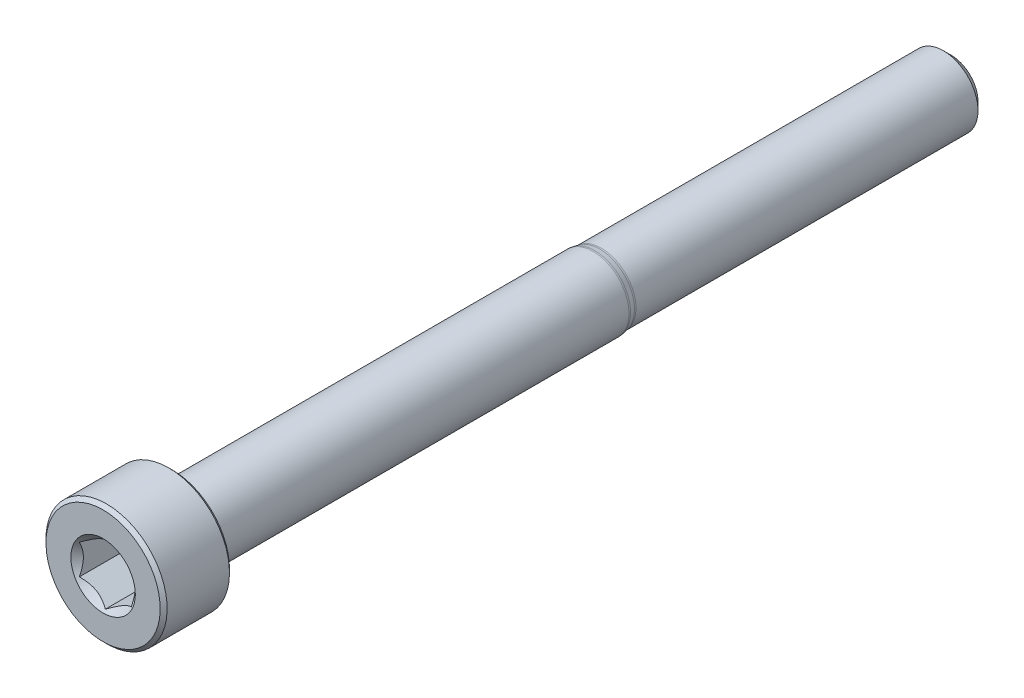
ISO-10303-21;
HEADER;
FILE_DESCRIPTION(('STEP AP214'),'2;1');
FILE_NAME('part.step','',(''),(''),'','','');
FILE_SCHEMA(('AUTOMOTIVE_DESIGN { 1 0 10303 214 1 1 1 1 }'));
ENDSEC;
DATA;
#1=APPLICATION_CONTEXT('core data for automotive mechanical design processes');
#2=APPLICATION_PROTOCOL_DEFINITION('international standard','automotive_design',2000,#1);
#3=PRODUCT_CONTEXT('',#1,'mechanical');
#4=PRODUCT('Part','Part','',(#3));
#5=PRODUCT_RELATED_PRODUCT_CATEGORY('part','',(#4));
#6=PRODUCT_DEFINITION_FORMATION('','',#4);
#7=PRODUCT_DEFINITION_CONTEXT('part definition',#1,'design');
#8=PRODUCT_DEFINITION('design','',#6,#7);
#9=PRODUCT_DEFINITION_SHAPE('','',#8);
#10=(LENGTH_UNIT() NAMED_UNIT(*) SI_UNIT(.MILLI.,.METRE.));
#11=(NAMED_UNIT(*) PLANE_ANGLE_UNIT() SI_UNIT($,.RADIAN.));
#12=(NAMED_UNIT(*) SI_UNIT($,.STERADIAN.) SOLID_ANGLE_UNIT());
#13=UNCERTAINTY_MEASURE_WITH_UNIT(LENGTH_MEASURE(1.E-05),#10,'distance_accuracy_value','');
#14=(GEOMETRIC_REPRESENTATION_CONTEXT(3) GLOBAL_UNCERTAINTY_ASSIGNED_CONTEXT((#13)) GLOBAL_UNIT_ASSIGNED_CONTEXT((#10,
#11,#12)) REPRESENTATION_CONTEXT('',''));
#15=CARTESIAN_POINT('',(0.,0.,0.));
#16=DIRECTION('',(0.,0.,1.));
#17=DIRECTION('',(1.,0.,0.));
#18=AXIS2_PLACEMENT_3D('',#15,#16,#17);
#19=CARTESIAN_POINT('',(0.,1.54533666301317,-24.5));
#20=DIRECTION('',(0.,0.,-1.));
#21=DIRECTION('',(0.,1.,0.));
#22=AXIS2_PLACEMENT_3D('',#19,#20,#21);
#23=PLANE('',#22);
#24=CARTESIAN_POINT('',(0.,0.,-24.5));
#25=DIRECTION('',(0.,0.,-1.));
#26=DIRECTION('',(0.,1.,0.));
#27=AXIS2_PLACEMENT_3D('',#24,#25,#26);
#28=CIRCLE('',#27,1.54533666301317);
#29=CARTESIAN_POINT('',(0.,1.54533666301317,-24.5));
#30=VERTEX_POINT('',#29);
#31=EDGE_CURVE('E51',#30,#30,#28,.T.);
#32=ORIENTED_EDGE('',*,*,#31,.T.);
#33=EDGE_LOOP('',(#32));
#34=FACE_BOUND('',#33,.T.);
#35=ADVANCED_FACE('F38',(#34),#23,.T.);
#36=CARTESIAN_POINT('',(0.,0.,-24.5));
#37=DIRECTION('',(0.,0.,1.));
#38=DIRECTION('',(0.,-1.,0.));
#39=AXIS2_PLACEMENT_3D('',#36,#37,#38);
#40=CONICAL_SURFACE('',#39,1.54533666301317,0.785398163397439);
#41=CARTESIAN_POINT('',(0.,0.,-24.0453366630132));
#42=DIRECTION('',(0.,0.,-1.));
#43=DIRECTION('',(0.,1.,0.));
#44=AXIS2_PLACEMENT_3D('',#41,#42,#43);
#45=CIRCLE('',#44,2.);
#46=CARTESIAN_POINT('',(0.,2.,-24.0453366630132));
#47=VERTEX_POINT('',#46);
#48=EDGE_CURVE('E166',#47,#47,#45,.T.);
#49=ORIENTED_EDGE('',*,*,#48,.T.);
#50=EDGE_LOOP('',(#49));
#51=FACE_BOUND('',#50,.T.);
#52=ORIENTED_EDGE('',*,*,#31,.F.);
#53=EDGE_LOOP('',(#52));
#54=FACE_BOUND('',#53,.T.);
#55=ADVANCED_FACE('F172',(#51,#54),#40,.T.);
#56=CARTESIAN_POINT('',(0.,0.,-24.5));
#57=DIRECTION('',(0.,0.,-1.));
#58=DIRECTION('',(0.,1.,0.));
#59=AXIS2_PLACEMENT_3D('',#56,#57,#58);
#60=CYLINDRICAL_SURFACE('',#59,2.);
#61=CARTESIAN_POINT('',(0.,0.,-4.28674570167858));
#62=DIRECTION('',(0.,0.,-1.));
#63=DIRECTION('',(0.,1.,0.));
#64=AXIS2_PLACEMENT_3D('',#61,#62,#63);
#65=CIRCLE('',#64,2.);
#66=CARTESIAN_POINT('',(0.,2.,-4.28674570167858));
#67=VERTEX_POINT('',#66);
#68=EDGE_CURVE('E163',#67,#67,#65,.T.);
#69=ORIENTED_EDGE('',*,*,#68,.T.);
#70=EDGE_LOOP('',(#69));
#71=FACE_BOUND('',#70,.T.);
#72=ORIENTED_EDGE('',*,*,#48,.F.);
#73=EDGE_LOOP('',(#72));
#74=FACE_BOUND('',#73,.T.);
#75=ADVANCED_FACE('F174',(#71,#74),#60,.T.);
#76=CARTESIAN_POINT('',(0.,0.,-4.28674570167858));
#77=DIRECTION('',(0.,0.,-1.));
#78=DIRECTION('',(0.,1.,0.));
#79=AXIS2_PLACEMENT_3D('',#76,#77,#78);
#80=TOROIDAL_SURFACE('',#79,2.5,0.5);
#81=CARTESIAN_POINT('',(0.,0.,-4.18920054067052));
#82=DIRECTION('',(0.,0.,-1.));
#83=DIRECTION('',(0.,1.,0.));
#84=AXIS2_PLACEMENT_3D('',#81,#82,#83);
#85=CIRCLE('',#84,2.00960735979838);
#86=CARTESIAN_POINT('',(0.,2.00960735979838,-4.18920054067052));
#87=VERTEX_POINT('',#86);
#88=EDGE_CURVE('E160',#87,#87,#85,.T.);
#89=ORIENTED_EDGE('',*,*,#88,.T.);
#90=EDGE_LOOP('',(#89));
#91=FACE_BOUND('',#90,.T.);
#92=ORIENTED_EDGE('',*,*,#68,.F.);
#93=EDGE_LOOP('',(#92));
#94=FACE_BOUND('',#93,.T.);
#95=ADVANCED_FACE('F180',(#91,#94),#80,.F.);
#96=CARTESIAN_POINT('',(0.,0.,-4.18920054067052));
#97=DIRECTION('',(0.,0.,1.));
#98=DIRECTION('',(0.,-1.,0.));
#99=AXIS2_PLACEMENT_3D('',#96,#97,#98);
#100=CONICAL_SURFACE('',#99,2.00960735979838,0.196349540849355);
#101=CARTESIAN_POINT('',(0.,0.,-3.90484163438686));
#102=DIRECTION('',(0.,0.,-1.));
#103=DIRECTION('',(0.,1.,0.));
#104=AXIS2_PLACEMENT_3D('',#101,#102,#103);
#105=CIRCLE('',#104,2.06616986303275);
#106=CARTESIAN_POINT('',(0.,2.06616986303275,-3.90484163438686));
#107=VERTEX_POINT('',#106);
#108=EDGE_CURVE('E157',#107,#107,#105,.T.);
#109=ORIENTED_EDGE('',*,*,#108,.T.);
#110=EDGE_LOOP('',(#109));
#111=FACE_BOUND('',#110,.T.);
#112=ORIENTED_EDGE('',*,*,#88,.F.);
#113=EDGE_LOOP('',(#112));
#114=FACE_BOUND('',#113,.T.);
#115=ADVANCED_FACE('F186',(#111,#114),#100,.T.);
#116=CARTESIAN_POINT('',(0.,0.,-3.8072964733788));
#117=DIRECTION('',(0.,0.,-1.));
#118=DIRECTION('',(0.,1.,0.));
#119=AXIS2_PLACEMENT_3D('',#116,#117,#118);
#120=TOROIDAL_SURFACE('',#119,1.57577722283114,0.5);
#121=CARTESIAN_POINT('',(0.,0.,-3.8072964733788));
#122=DIRECTION('',(0.,0.,-1.));
#123=DIRECTION('',(0.,1.,0.));
#124=AXIS2_PLACEMENT_3D('',#121,#122,#123);
#125=CIRCLE('',#124,2.07577722283114);
#126=CARTESIAN_POINT('',(0.,2.07577722283114,-3.8072964733788));
#127=VERTEX_POINT('',#126);
#128=EDGE_CURVE('E154',#127,#127,#125,.T.);
#129=ORIENTED_EDGE('',*,*,#128,.T.);
#130=EDGE_LOOP('',(#129));
#131=FACE_BOUND('',#130,.T.);
#132=ORIENTED_EDGE('',*,*,#108,.F.);
#133=EDGE_LOOP('',(#132));
#134=FACE_BOUND('',#133,.T.);
#135=ADVANCED_FACE('F190',(#131,#134),#120,.T.);
#136=CARTESIAN_POINT('',(0.,0.,-24.5));
#137=DIRECTION('',(0.,0.,-1.));
#138=DIRECTION('',(0.,1.,0.));
#139=AXIS2_PLACEMENT_3D('',#136,#137,#138);
#140=CYLINDRICAL_SURFACE('',#139,2.07577722283114);
#141=CARTESIAN_POINT('',(0.,0.,20.3));
#142=DIRECTION('',(0.,0.,-1.));
#143=DIRECTION('',(0.,1.,0.));
#144=AXIS2_PLACEMENT_3D('',#141,#142,#143);
#145=CIRCLE('',#144,2.07577722283114);
#146=CARTESIAN_POINT('',(0.,2.07577722283114,20.3));
#147=VERTEX_POINT('',#146);
#148=EDGE_CURVE('E151',#147,#147,#145,.T.);
#149=ORIENTED_EDGE('',*,*,#148,.T.);
#150=EDGE_LOOP('',(#149));
#151=FACE_BOUND('',#150,.T.);
#152=ORIENTED_EDGE('',*,*,#128,.F.);
#153=EDGE_LOOP('',(#152));
#154=FACE_BOUND('',#153,.T.);
#155=ADVANCED_FACE('F194',(#151,#154),#140,.T.);
#156=CARTESIAN_POINT('',(0.,0.,20.3));
#157=DIRECTION('',(0.,0.,-1.));
#158=DIRECTION('',(0.,1.,0.));
#159=AXIS2_PLACEMENT_3D('',#156,#157,#158);
#160=TOROIDAL_SURFACE('',#159,2.27577722283114,0.2);
#161=CARTESIAN_POINT('',(0.,0.,20.5));
#162=DIRECTION('',(0.,0.,-1.));
#163=DIRECTION('',(0.,1.,0.));
#164=AXIS2_PLACEMENT_3D('',#161,#162,#163);
#165=CIRCLE('',#164,2.27577722283114);
#166=CARTESIAN_POINT('',(0.,2.27577722283114,20.5));
#167=VERTEX_POINT('',#166);
#168=EDGE_CURVE('E148',#167,#167,#165,.T.);
#169=ORIENTED_EDGE('',*,*,#168,.T.);
#170=EDGE_LOOP('',(#169));
#171=FACE_BOUND('',#170,.T.);
#172=ORIENTED_EDGE('',*,*,#148,.F.);
#173=EDGE_LOOP('',(#172));
#174=FACE_BOUND('',#173,.T.);
#175=ADVANCED_FACE('F198',(#171,#174),#160,.F.);
#176=CARTESIAN_POINT('',(0.,3.3,20.5));
#177=DIRECTION('',(0.,0.,-1.));
#178=DIRECTION('',(0.,1.,0.));
#179=AXIS2_PLACEMENT_3D('',#176,#177,#178);
#180=PLANE('',#179);
#181=CARTESIAN_POINT('',(0.,0.,20.5));
#182=DIRECTION('',(0.,0.,-1.));
#183=DIRECTION('',(0.,1.,0.));
#184=AXIS2_PLACEMENT_3D('',#181,#182,#183);
#185=CIRCLE('',#184,3.3);
#186=CARTESIAN_POINT('',(0.,3.3,20.5));
#187=VERTEX_POINT('',#186);
#188=EDGE_CURVE('E145',#187,#187,#185,.T.);
#189=ORIENTED_EDGE('',*,*,#188,.T.);
#190=EDGE_LOOP('',(#189));
#191=FACE_BOUND('',#190,.T.);
#192=ORIENTED_EDGE('',*,*,#168,.F.);
#193=EDGE_LOOP('',(#192));
#194=FACE_BOUND('',#193,.T.);
#195=ADVANCED_FACE('F202',(#191,#194),#180,.T.);
#196=CARTESIAN_POINT('',(0.,0.,20.5));
#197=DIRECTION('',(0.,0.,1.));
#198=DIRECTION('',(0.,-1.,0.));
#199=AXIS2_PLACEMENT_3D('',#196,#197,#198);
#200=CONICAL_SURFACE('',#199,3.3,0.785398163397452);
#201=CARTESIAN_POINT('',(0.,0.,20.7));
#202=DIRECTION('',(0.,0.,-1.));
#203=DIRECTION('',(0.,1.,0.));
#204=AXIS2_PLACEMENT_3D('',#201,#202,#203);
#205=CIRCLE('',#204,3.5);
#206=CARTESIAN_POINT('',(0.,3.5,20.7));
#207=VERTEX_POINT('',#206);
#208=EDGE_CURVE('E142',#207,#207,#205,.T.);
#209=ORIENTED_EDGE('',*,*,#208,.T.);
#210=EDGE_LOOP('',(#209));
#211=FACE_BOUND('',#210,.T.);
#212=ORIENTED_EDGE('',*,*,#188,.F.);
#213=EDGE_LOOP('',(#212));
#214=FACE_BOUND('',#213,.T.);
#215=ADVANCED_FACE('F206',(#211,#214),#200,.T.);
#216=CARTESIAN_POINT('',(0.,0.,-24.5));
#217=DIRECTION('',(0.,0.,-1.));
#218=DIRECTION('',(0.,1.,0.));
#219=AXIS2_PLACEMENT_3D('',#216,#217,#218);
#220=CYLINDRICAL_SURFACE('',#219,3.5);
#221=CARTESIAN_POINT('',(0.,0.,24.3));
#222=DIRECTION('',(0.,0.,-1.));
#223=DIRECTION('',(0.,1.,0.));
#224=AXIS2_PLACEMENT_3D('',#221,#222,#223);
#225=CIRCLE('',#224,3.5);
#226=CARTESIAN_POINT('',(0.,3.5,24.3));
#227=VERTEX_POINT('',#226);
#228=EDGE_CURVE('E139',#227,#227,#225,.T.);
#229=ORIENTED_EDGE('',*,*,#228,.T.);
#230=EDGE_LOOP('',(#229));
#231=FACE_BOUND('',#230,.T.);
#232=ORIENTED_EDGE('',*,*,#208,.F.);
#233=EDGE_LOOP('',(#232));
#234=FACE_BOUND('',#233,.T.);
#235=ADVANCED_FACE('F210',(#231,#234),#220,.T.);
#236=CARTESIAN_POINT('',(0.,0.,24.3));
#237=DIRECTION('',(0.,0.,-1.));
#238=DIRECTION('',(0.,1.,0.));
#239=AXIS2_PLACEMENT_3D('',#236,#237,#238);
#240=CONICAL_SURFACE('',#239,3.5,0.785398163397452);
#241=CARTESIAN_POINT('',(0.,0.,24.5));
#242=DIRECTION('',(0.,0.,-1.));
#243=DIRECTION('',(0.,1.,0.));
#244=AXIS2_PLACEMENT_3D('',#241,#242,#243);
#245=CIRCLE('',#244,3.3);
#246=CARTESIAN_POINT('',(0.,3.3,24.5));
#247=VERTEX_POINT('',#246);
#248=EDGE_CURVE('E136',#247,#247,#245,.T.);
#249=ORIENTED_EDGE('',*,*,#248,.T.);
#250=EDGE_LOOP('',(#249));
#251=FACE_BOUND('',#250,.T.);
#252=ORIENTED_EDGE('',*,*,#228,.F.);
#253=EDGE_LOOP('',(#252));
#254=FACE_BOUND('',#253,.T.);
#255=ADVANCED_FACE('F214',(#251,#254),#240,.T.);
#256=CARTESIAN_POINT('',(0.,0.,24.5));
#257=DIRECTION('',(0.,0.,1.));
#258=DIRECTION('',(0.,-1.,0.));
#259=AXIS2_PLACEMENT_3D('',#256,#257,#258);
#260=PLANE('',#259);
#261=CARTESIAN_POINT('',(0.,0.,24.5));
#262=DIRECTION('',(0.,0.,1.));
#263=DIRECTION('',(1.,0.,0.));
#264=AXIS2_PLACEMENT_3D('',#261,#262,#263);
#265=CIRCLE('',#264,1.86195461813654);
#266=CARTESIAN_POINT('',(1.86195461813654,0.,24.5));
#267=VERTEX_POINT('',#266);
#268=EDGE_CURVE('E110',#267,#267,#265,.T.);
#269=ORIENTED_EDGE('',*,*,#268,.F.);
#270=EDGE_LOOP('',(#269));
#271=FACE_BOUND('',#270,.T.);
#272=ORIENTED_EDGE('',*,*,#248,.F.);
#273=EDGE_LOOP('',(#272));
#274=FACE_BOUND('',#273,.T.);
#275=ADVANCED_FACE('F218',(#271,#274),#260,.T.);
#276=CARTESIAN_POINT('',(0.,0.,24.5));
#277=DIRECTION('',(0.,0.,1.));
#278=DIRECTION('',(1.,0.,0.));
#279=AXIS2_PLACEMENT_3D('',#276,#277,#278);
#280=CONICAL_SURFACE('',#279,1.86195461813654,0.78539816339745);
#281=ORIENTED_EDGE('',*,*,#268,.T.);
#282=EDGE_LOOP('',(#281));
#283=FACE_BOUND('',#282,.T.);
#284=CARTESIAN_POINT('',(-0.000199999999999613,-1.73216627762272,24.3702116710324));
#285=CARTESIAN_POINT('',(0.051367790737076,-1.70239359975915,24.3404616654997));
#286=CARTESIAN_POINT('',(0.103797917665201,-1.67212305186355,24.3124586733426));
#287=CARTESIAN_POINT('',(0.210709034055597,-1.61039789003619,24.2611854198725));
#288=CARTESIAN_POINT('',(0.265200195814662,-1.57893740312614,24.2379436944767));
#289=CARTESIAN_POINT('',(0.37507908135725,-1.51549879897987,24.1981299184246));
#290=CARTESIAN_POINT('',(0.430438809095201,-1.4835368452681,24.1814577751032));
#291=CARTESIAN_POINT('',(0.542377257477151,-1.41890915196211,24.1557706462504));
#292=CARTESIAN_POINT('',(0.598952556553009,-1.38624538781118,24.1467364799112));
#293=CARTESIAN_POINT('',(0.696455389516442,-1.32995210095299,24.1385852706592));
#294=CARTESIAN_POINT('',(0.737256908280467,-1.30639533311124,24.1373784424216));
#295=CARTESIAN_POINT('',(0.818787969615859,-1.25932335290193,24.1394102465946));
#296=CARTESIAN_POINT('',(0.859517494314631,-1.23580815085313,24.1426498601806));
#297=CARTESIAN_POINT('',(0.940584402163417,-1.18900414978426,24.1533881754143));
#298=CARTESIAN_POINT('',(0.980921384598289,-1.16571558211719,24.1608908424511));
#299=CARTESIAN_POINT('',(1.06091833691403,-1.11952932016335,24.1797478013606));
#300=CARTESIAN_POINT('',(1.10057800851621,-1.09663179808786,24.1911037464509));
#301=CARTESIAN_POINT('',(1.20216313477449,-1.03798159809698,24.224817837025));
#302=CARTESIAN_POINT('',(1.26345855370969,-1.00259267147465,24.2497180385257));
#303=CARTESIAN_POINT('',(1.35358562846331,-0.950557780604375,24.2917528427039));
#304=CARTESIAN_POINT('',(1.38328513990772,-0.933410759677148,24.3065213429914));
#305=CARTESIAN_POINT('',(1.44213790138375,-0.899432101996407,24.3374067553725));
#306=CARTESIAN_POINT('',(1.47129140422064,-0.88260031928571,24.353523023554));
#307=CARTESIAN_POINT('',(1.5002,-0.8659099337306,24.3702116710324));
#308=B_SPLINE_CURVE_WITH_KNOTS('',3,(#284,#285,#286,#287,#288,#289,#290,#291,#292,#293,#294,
#295,#296,#297,#298,#299,#300,#301,#302,#303,#304,#305,#306,#307),.UNSPECIFIED.,.F.,.F.,(4,2,2,
2,2,2,2,2,2,2,2,4),(0.,0.199829143693306,0.40082298738239,0.598623720538182,0.79592624018889,
0.937113067959882,1.07833105577193,1.21968061668222,1.36109089931055,1.58570969637565,
1.69770705470963,1.80965120737194),.UNSPECIFIED.);
#309=CARTESIAN_POINT('',(0.,-1.73205080756888,24.3700961894323));
#310=VERTEX_POINT('',#309);
#311=CARTESIAN_POINT('',(1.5,-0.866025403784438,24.3700961894323));
#312=VERTEX_POINT('',#311);
#313=EDGE_CURVE('E12',#310,#312,#308,.T.);
#314=ORIENTED_EDGE('',*,*,#313,.F.);
#315=CARTESIAN_POINT('',(-1.5002,-0.865909933730601,24.3702116710324));
#316=CARTESIAN_POINT('',(-1.44863220926292,-0.895682611594166,24.3404616654997));
#317=CARTESIAN_POINT('',(-1.3962020823348,-0.925953159489766,24.3124586733426));
#318=CARTESIAN_POINT('',(-1.2892909659444,-0.987678321317124,24.2611854198725));
#319=CARTESIAN_POINT('',(-1.23479980418534,-1.01913880822718,24.2379436944767));
#320=CARTESIAN_POINT('',(-1.12492091864275,-1.08257741237344,24.1981299184246));
#321=CARTESIAN_POINT('',(-1.0695611909048,-1.11453936608521,24.1814577751032));
#322=CARTESIAN_POINT('',(-0.957622742522848,-1.1791670593912,24.1557706462504));
#323=CARTESIAN_POINT('',(-0.90104744344699,-1.21183082354213,24.1467364799112));
#324=CARTESIAN_POINT('',(-0.803544610483558,-1.26812411040032,24.1385852706592));
#325=CARTESIAN_POINT('',(-0.762743091719533,-1.29168087824208,24.1373784424216));
#326=CARTESIAN_POINT('',(-0.681212030384141,-1.33875285845138,24.1394102465946));
#327=CARTESIAN_POINT('',(-0.640482505685369,-1.36226806050018,24.1426498601806));
#328=CARTESIAN_POINT('',(-0.559415597836583,-1.40907206156905,24.1533881754143));
#329=CARTESIAN_POINT('',(-0.519078615401711,-1.43236062923612,24.1608908424511));
#330=CARTESIAN_POINT('',(-0.439081663085968,-1.47854689118997,24.1797478013606));
#331=CARTESIAN_POINT('',(-0.399421991483791,-1.50144441326545,24.1911037464509));
#332=CARTESIAN_POINT('',(-0.297836865225514,-1.56009461325633,24.224817837025));
#333=CARTESIAN_POINT('',(-0.23654144629031,-1.59548353987866,24.2497180385257));
#334=CARTESIAN_POINT('',(-0.146414371536686,-1.64751843074894,24.2917528427039));
#335=CARTESIAN_POINT('',(-0.116714860092282,-1.66466545167617,24.3065213429914));
#336=CARTESIAN_POINT('',(-0.057862098616249,-1.69864410935691,24.3374067553725));
#337=CARTESIAN_POINT('',(-0.0287085957793625,-1.71547589206761,24.353523023554));
#338=CARTESIAN_POINT('',(0.000200000000000539,-1.73216627762272,24.3702116710324));
#339=B_SPLINE_CURVE_WITH_KNOTS('',3,(#315,#316,#317,#318,#319,#320,#321,#322,#323,#324,#325,
#326,#327,#328,#329,#330,#331,#332,#333,#334,#335,#336,#337,#338),.UNSPECIFIED.,.F.,.F.,(4,2,2,
2,2,2,2,2,2,2,2,4),(0.,0.199829143693306,0.40082298738239,0.598623720538182,0.795926240188891,
0.937113067959882,1.07833105577193,1.21968061668222,1.36109089931055,1.58570969637566,
1.69770705470964,1.80965120737194),.UNSPECIFIED.);
#340=CARTESIAN_POINT('',(-1.5,-0.866025403784439,24.3700961894323));
#341=VERTEX_POINT('',#340);
#342=EDGE_CURVE('E96',#341,#310,#339,.T.);
#343=ORIENTED_EDGE('',*,*,#342,.F.);
#344=CARTESIAN_POINT('',(-1.5,-1.81798644339826,24.9949659805218));
#345=CARTESIAN_POINT('',(-1.5,-1.7741049212163,24.9611234480288));
#346=CARTESIAN_POINT('',(-1.5,-1.7299890896826,24.927585707746));
#347=CARTESIAN_POINT('',(-1.5,-1.64119040614349,24.8612482560218));
#348=CARTESIAN_POINT('',(-1.5,-1.59650742345673,24.8284487196869));
#349=CARTESIAN_POINT('',(-1.5,-1.46080703724549,24.7308819989223));
#350=CARTESIAN_POINT('',(-1.5,-1.36880260139859,24.6674654805716));
#351=CARTESIAN_POINT('',(-1.5,-1.17526244907484,24.5421024160959));
#352=CARTESIAN_POINT('',(-1.5,-1.07349399309978,24.4805114517827));
#353=CARTESIAN_POINT('',(-1.5,-0.864764886493364,24.367252227632));
#354=CARTESIAN_POINT('',(-1.5,-0.757823368449898,24.3155504543104));
#355=CARTESIAN_POINT('',(-1.5,-0.598146096468989,24.2522731835563));
#356=CARTESIAN_POINT('',(-1.5,-0.547969975291046,24.2342740943257));
#357=CARTESIAN_POINT('',(-1.5,-0.446326905726014,24.2022954757007));
#358=CARTESIAN_POINT('',(-1.5,-0.39485987612543,24.1883161998935));
#359=CARTESIAN_POINT('',(-1.5,-0.291848443786788,24.1653656993307));
#360=CARTESIAN_POINT('',(-1.5,-0.240324799163318,24.1563028233891));
#361=CARTESIAN_POINT('',(-1.5,-0.136625504447977,24.1433771204074));
#362=CARTESIAN_POINT('',(-1.5,-0.0844499953262876,24.1395131880538));
#363=CARTESIAN_POINT('',(-1.5,0.017680632277305,24.1373196118873));
#364=CARTESIAN_POINT('',(-1.5,0.0676306379007709,24.1387500662965));
#365=CARTESIAN_POINT('',(-1.5,0.167145406902043,24.1465133064628));
#366=CARTESIAN_POINT('',(-1.5,0.216710135235096,24.1528465330246));
#367=CARTESIAN_POINT('',(-1.5,0.315937074154246,24.1701627013475));
#368=CARTESIAN_POINT('',(-1.5,0.365584655317233,24.181228133276));
#369=CARTESIAN_POINT('',(-1.5,0.463781524266198,24.2073934750171));
#370=CARTESIAN_POINT('',(-1.5,0.512330870231959,24.2224931705662));
#371=CARTESIAN_POINT('',(-1.5,0.661312921957409,24.2746138155249));
#372=CARTESIAN_POINT('',(-1.5,0.759720673218968,24.3174049108191));
#373=CARTESIAN_POINT('',(-1.5,0.951942523388261,24.4126387595345));
#374=CARTESIAN_POINT('',(-1.5,1.0457389623009,24.465115435405));
#375=CARTESIAN_POINT('',(-1.5,1.22504135106297,24.573478220585));
#376=CARTESIAN_POINT('',(-1.5,1.31072808141301,24.6290689766907));
#377=CARTESIAN_POINT('',(-1.5,1.43696938793222,24.7150503092413));
#378=CARTESIAN_POINT('',(-1.5,1.47850703658459,24.7440225300034));
#379=CARTESIAN_POINT('',(-1.5,1.56101227498314,24.8027447189929));
#380=CARTESIAN_POINT('',(-1.5,1.60198001874048,24.8324944705885));
#381=CARTESIAN_POINT('',(-1.5,1.64271005760726,24.862566978379));
#382=B_SPLINE_CURVE_WITH_KNOTS('',3,(#344,#345,#346,#347,#348,#349,#350,#351,#352,#353,#354,
#355,#356,#357,#358,#359,#360,#361,#362,#363,#364,#365,#366,#367,#368,#369,#370,#371,#372,#373,
#374,#375,#376,#377,#378,#379,#380,#381),.UNSPECIFIED.,.F.,.F.,(4,2,2,2,2,2,2,2,2,2,2,2,2,2,2,2,
2,2,4),(0.,0.16624326595874,0.332525558867044,0.667617646006965,1.02421670216266,
1.37958499445802,1.53937198099665,1.69916904537709,1.85587476796104,2.01254716909175,
2.16220908021825,2.3118844489035,2.4642826618586,2.61667278241372,2.93766302990029,
3.25979960403481,3.56606520142079,3.71798977734031,3.8698724667598),.UNSPECIFIED.);
#383=CARTESIAN_POINT('',(-1.5,0.866025403784438,24.3700961894323));
#384=VERTEX_POINT('',#383);
#385=EDGE_CURVE('E109',#384,#341,#382,.F.);
#386=ORIENTED_EDGE('',*,*,#385,.F.);
#387=CARTESIAN_POINT('',(0.000199999999999576,1.73216627762272,24.3702116710324));
#388=CARTESIAN_POINT('',(-0.051367790737076,1.70239359975915,24.3404616654997));
#389=CARTESIAN_POINT('',(-0.103797917665201,1.67212305186355,24.3124586733426));
#390=CARTESIAN_POINT('',(-0.210709034055597,1.61039789003619,24.2611854198725));
#391=CARTESIAN_POINT('',(-0.265200195814662,1.57893740312614,24.2379436944767));
#392=CARTESIAN_POINT('',(-0.37507908135725,1.51549879897987,24.1981299184246));
#393=CARTESIAN_POINT('',(-0.4304388090952,1.4835368452681,24.1814577751032));
#394=CARTESIAN_POINT('',(-0.542377257477151,1.41890915196211,24.1557706462504));
#395=CARTESIAN_POINT('',(-0.598952556553009,1.38624538781118,24.1467364799112));
#396=CARTESIAN_POINT('',(-0.696455389516441,1.32995210095299,24.1385852706592));
#397=CARTESIAN_POINT('',(-0.737256908280467,1.30639533311124,24.1373784424216));
#398=CARTESIAN_POINT('',(-0.818787969615859,1.25932335290193,24.1394102465946));
#399=CARTESIAN_POINT('',(-0.859517494314631,1.23580815085313,24.1426498601806));
#400=CARTESIAN_POINT('',(-0.940584402163417,1.18900414978427,24.1533881754143));
#401=CARTESIAN_POINT('',(-0.980921384598289,1.16571558211719,24.1608908424511));
#402=CARTESIAN_POINT('',(-1.06091833691403,1.11952932016335,24.1797478013606));
#403=CARTESIAN_POINT('',(-1.10057800851621,1.09663179808786,24.1911037464509));
#404=CARTESIAN_POINT('',(-1.20216313477449,1.03798159809698,24.224817837025));
#405=CARTESIAN_POINT('',(-1.26345855370969,1.00259267147465,24.2497180385257));
#406=CARTESIAN_POINT('',(-1.35358562846331,0.950557780604375,24.2917528427039));
#407=CARTESIAN_POINT('',(-1.38328513990772,0.933410759677148,24.3065213429914));
#408=CARTESIAN_POINT('',(-1.44213790138375,0.899432101996407,24.3374067553725));
#409=CARTESIAN_POINT('',(-1.47129140422064,0.88260031928571,24.353523023554));
#410=CARTESIAN_POINT('',(-1.5002,0.865909933730601,24.3702116710324));
#411=B_SPLINE_CURVE_WITH_KNOTS('',3,(#387,#388,#389,#390,#391,#392,#393,#394,#395,#396,#397,
#398,#399,#400,#401,#402,#403,#404,#405,#406,#407,#408,#409,#410),.UNSPECIFIED.,.F.,.F.,(4,2,2,
2,2,2,2,2,2,2,2,4),(0.,0.199829143693306,0.40082298738239,0.598623720538182,0.79592624018889,
0.937113067959882,1.07833105577193,1.21968061668222,1.36109089931055,1.58570969637565,
1.69770705470963,1.80965120737194),.UNSPECIFIED.);
#412=CARTESIAN_POINT('',(0.,1.73205080756888,24.3700961894323));
#413=VERTEX_POINT('',#412);
#414=EDGE_CURVE('E268',#413,#384,#411,.T.);
#415=ORIENTED_EDGE('',*,*,#414,.F.);
#416=CARTESIAN_POINT('',(1.5002,0.865909933730601,24.3702116710324));
#417=CARTESIAN_POINT('',(1.44863220926292,0.895682611594166,24.3404616654997));
#418=CARTESIAN_POINT('',(1.3962020823348,0.925953159489765,24.3124586733426));
#419=CARTESIAN_POINT('',(1.2892909659444,0.987678321317124,24.2611854198725));
#420=CARTESIAN_POINT('',(1.23479980418534,1.01913880822718,24.2379436944767));
#421=CARTESIAN_POINT('',(1.12492091864275,1.08257741237344,24.1981299184246));
#422=CARTESIAN_POINT('',(1.0695611909048,1.11453936608521,24.1814577751032));
#423=CARTESIAN_POINT('',(0.957622742522848,1.1791670593912,24.1557706462504));
#424=CARTESIAN_POINT('',(0.90104744344699,1.21183082354213,24.1467364799112));
#425=CARTESIAN_POINT('',(0.803544610483558,1.26812411040032,24.1385852706592));
#426=CARTESIAN_POINT('',(0.762743091719532,1.29168087824208,24.1373784424216));
#427=CARTESIAN_POINT('',(0.68121203038414,1.33875285845138,24.1394102465946));
#428=CARTESIAN_POINT('',(0.640482505685369,1.36226806050018,24.1426498601806));
#429=CARTESIAN_POINT('',(0.559415597836582,1.40907206156905,24.1533881754143));
#430=CARTESIAN_POINT('',(0.51907861540171,1.43236062923612,24.1608908424511));
#431=CARTESIAN_POINT('',(0.439081663085968,1.47854689118997,24.1797478013606));
#432=CARTESIAN_POINT('',(0.39942199148379,1.50144441326545,24.1911037464509));
#433=CARTESIAN_POINT('',(0.297836865225514,1.56009461325633,24.224817837025));
#434=CARTESIAN_POINT('',(0.23654144629031,1.59548353987866,24.2497180385257));
#435=CARTESIAN_POINT('',(0.146414371536686,1.64751843074894,24.2917528427039));
#436=CARTESIAN_POINT('',(0.116714860092282,1.66466545167617,24.3065213429914));
#437=CARTESIAN_POINT('',(0.0578620986162493,1.69864410935691,24.3374067553725));
#438=CARTESIAN_POINT('',(0.028708595779363,1.71547589206761,24.353523023554));
#439=CARTESIAN_POINT('',(-0.0001999999999999,1.73216627762271,24.3702116710324));
#440=B_SPLINE_CURVE_WITH_KNOTS('',3,(#416,#417,#418,#419,#420,#421,#422,#423,#424,#425,#426,
#427,#428,#429,#430,#431,#432,#433,#434,#435,#436,#437,#438,#439),.UNSPECIFIED.,.F.,.F.,(4,2,2,
2,2,2,2,2,2,2,2,4),(0.,0.199829143693306,0.40082298738239,0.598623720538183,0.795926240188891,
0.937113067959883,1.07833105577193,1.21968061668222,1.36109089931055,1.58570969637566,
1.69770705470964,1.80965120737194),.UNSPECIFIED.);
#441=CARTESIAN_POINT('',(1.5,0.866025403784439,24.3700961894323));
#442=VERTEX_POINT('',#441);
#443=EDGE_CURVE('E241',#442,#413,#440,.T.);
#444=ORIENTED_EDGE('',*,*,#443,.F.);
#445=CARTESIAN_POINT('',(1.5,-1.81798631684901,24.9949658829093));
#446=CARTESIAN_POINT('',(1.5,-1.77410479833239,24.961123354197));
#447=CARTESIAN_POINT('',(1.5,-1.72998897047494,24.927585617689));
#448=CARTESIAN_POINT('',(1.5,-1.64119029432319,24.8612481734927));
#449=CARTESIAN_POINT('',(1.5,-1.59650731534755,24.828448640911));
#450=CARTESIAN_POINT('',(1.5,-1.460806940489,24.7308819314804));
#451=CARTESIAN_POINT('',(1.5,-1.36880251235632,24.6674654206559));
#452=CARTESIAN_POINT('',(1.5,-1.17526237686872,24.5421023717216));
#453=CARTESIAN_POINT('',(1.5,-1.07349393006072,24.4805114153672));
#454=CARTESIAN_POINT('',(1.5,-0.86476484256063,24.3672522059965));
#455=CARTESIAN_POINT('',(1.5,-0.75782333444995,24.3155504395058));
#456=CARTESIAN_POINT('',(1.5,-0.598146069886857,24.2522731736164));
#457=CARTESIAN_POINT('',(1.5,-0.547969945491555,24.2342740839912));
#458=CARTESIAN_POINT('',(1.5,-0.446326869364772,24.2022954652208));
#459=CARTESIAN_POINT('',(1.5,-0.394859836419922,24.1883161896624));
#460=CARTESIAN_POINT('',(1.5,-0.291848397493322,24.1653656903726));
#461=CARTESIAN_POINT('',(1.5,-0.240324749628768,24.1563028154328));
#462=CARTESIAN_POINT('',(1.5,-0.136625448515907,24.1433771152152));
#463=CARTESIAN_POINT('',(1.5,-0.0844499362377768,24.1395131846234));
#464=CARTESIAN_POINT('',(1.5,0.0176806967011162,24.1373196125689));
#465=CARTESIAN_POINT('',(1.5,0.0676307045116647,24.1387500692366));
#466=CARTESIAN_POINT('',(1.5,0.167145477637763,24.1465133142386));
#467=CARTESIAN_POINT('',(1.5,0.216710207908516,24.1528465433779));
#468=CARTESIAN_POINT('',(1.5,0.315937150651984,24.1701627170715));
#469=CARTESIAN_POINT('',(1.5,0.36558473369454,24.1812281518103));
#470=CARTESIAN_POINT('',(1.5,0.463781606198771,24.2073934991991));
#471=CARTESIAN_POINT('',(1.5,0.51233095384026,24.2224931975855));
#472=CARTESIAN_POINT('',(1.5,0.661313023287692,24.2746138556917));
#473=CARTESIAN_POINT('',(1.5,0.759720789706279,24.3174049630424));
#474=CARTESIAN_POINT('',(1.5,0.951942669022773,24.4126388372101));
#475=CARTESIAN_POINT('',(1.5,1.04573912191845,24.465115526486));
#476=CARTESIAN_POINT('',(1.5,1.22504153577549,24.5734783373155));
#477=CARTESIAN_POINT('',(1.5,1.3107282773288,24.6290691055441));
#478=CARTESIAN_POINT('',(1.5,1.43696960041028,24.7150504562164));
#479=CARTESIAN_POINT('',(1.5,1.47850725450333,24.7440226829709));
#480=CARTESIAN_POINT('',(1.5,1.56101250374723,24.8027448839378));
#481=CARTESIAN_POINT('',(1.5,1.60198025290925,24.8324946415183));
#482=CARTESIAN_POINT('',(1.5,1.64271029717086,24.862567155286));
#483=B_SPLINE_CURVE_WITH_KNOTS('',3,(#445,#446,#447,#448,#449,#450,#451,#452,#453,#454,#455,
#456,#457,#458,#459,#460,#461,#462,#463,#464,#465,#466,#467,#468,#469,#470,#471,#472,#473,#474,
#475,#476,#477,#478,#479,#480,#481,#482),.UNSPECIFIED.,.F.,.F.,(4,2,2,2,2,2,2,2,2,2,2,2,2,2,2,2,
2,2,4),(0.,0.166243250325253,0.332525527595492,0.667617582874062,1.02421660314856,
1.37958485991001,1.53937185590113,1.69916892971772,1.85587466130012,2.01254707142443,
2.16220898927398,2.31188436469119,2.46428258498153,2.61667271286895,2.93766301623296,
3.25979964661299,3.56606529199603,3.71798989158865,3.86987260467919),.UNSPECIFIED.);
#484=EDGE_CURVE('E58',#312,#442,#483,.T.);
#485=ORIENTED_EDGE('',*,*,#484,.F.);
#486=EDGE_LOOP('',(#314,#343,#386,#415,#444,#485));
#487=FACE_BOUND('',#486,.T.);
#488=ADVANCED_FACE('F95',(#283,#487),#280,.F.);
#489=CARTESIAN_POINT('',(0.,3.3,21.5));
#490=DIRECTION('',(0.,0.,-1.));
#491=DIRECTION('',(0.,1.,0.));
#492=AXIS2_PLACEMENT_3D('',#489,#490,#491);
#493=PLANE('',#492);
#494=DIRECTION('',(0.866025403784438,0.5,0.));
#495=VECTOR('',#494,1.);
#496=CARTESIAN_POINT('',(0.,-1.73205080756888,21.5));
#497=LINE('',#496,#495);
#498=CARTESIAN_POINT('',(0.,-1.73205080756888,21.5));
#499=VERTEX_POINT('',#498);
#500=CARTESIAN_POINT('',(1.5,-0.866025403784438,21.5));
#501=VERTEX_POINT('',#500);
#502=EDGE_CURVE('E113',#499,#501,#497,.T.);
#503=ORIENTED_EDGE('',*,*,#502,.T.);
#504=DIRECTION('',(0.,1.,0.));
#505=VECTOR('',#504,1.);
#506=CARTESIAN_POINT('',(1.5,-0.866025403784438,21.5));
#507=LINE('',#506,#505);
#508=CARTESIAN_POINT('',(1.5,0.866025403784439,21.5));
#509=VERTEX_POINT('',#508);
#510=EDGE_CURVE('E65',#501,#509,#507,.T.);
#511=ORIENTED_EDGE('',*,*,#510,.T.);
#512=DIRECTION('',(-0.866025403784439,0.5,0.));
#513=VECTOR('',#512,1.);
#514=CARTESIAN_POINT('',(1.5,0.866025403784439,21.5));
#515=LINE('',#514,#513);
#516=CARTESIAN_POINT('',(0.,1.73205080756888,21.5));
#517=VERTEX_POINT('',#516);
#518=EDGE_CURVE('E121',#509,#517,#515,.T.);
#519=ORIENTED_EDGE('',*,*,#518,.T.);
#520=DIRECTION('',(-0.866025403784439,-0.5,0.));
#521=VECTOR('',#520,1.);
#522=CARTESIAN_POINT('',(0.,1.73205080756888,21.5));
#523=LINE('',#522,#521);
#524=CARTESIAN_POINT('',(-1.5,0.866025403784438,21.5));
#525=VERTEX_POINT('',#524);
#526=EDGE_CURVE('E128',#517,#525,#523,.T.);
#527=ORIENTED_EDGE('',*,*,#526,.T.);
#528=DIRECTION('',(0.,-1.,0.));
#529=VECTOR('',#528,1.);
#530=CARTESIAN_POINT('',(-1.5,0.866025403784438,21.5));
#531=LINE('',#530,#529);
#532=CARTESIAN_POINT('',(-1.5,-0.866025403784439,21.5));
#533=VERTEX_POINT('',#532);
#534=EDGE_CURVE('E124',#525,#533,#531,.T.);
#535=ORIENTED_EDGE('',*,*,#534,.T.);
#536=DIRECTION('',(0.866025403784439,-0.5,0.));
#537=VECTOR('',#536,1.);
#538=CARTESIAN_POINT('',(-1.5,-0.866025403784439,21.5));
#539=LINE('',#538,#537);
#540=EDGE_CURVE('E114',#533,#499,#539,.T.);
#541=ORIENTED_EDGE('',*,*,#540,.T.);
#542=EDGE_LOOP('',(#503,#511,#519,#527,#535,#541));
#543=FACE_BOUND('',#542,.T.);
#544=ADVANCED_FACE('F223',(#543),#493,.F.);
#545=CARTESIAN_POINT('',(0.,-1.73205080756888,15.9174243050442));
#546=DIRECTION('',(0.5,-0.866025403784438,0.));
#547=DIRECTION('',(0.866025403784438,0.5,0.));
#548=AXIS2_PLACEMENT_3D('',#545,#546,#547);
#549=PLANE('',#548);
#550=DIRECTION('',(0.,0.,1.));
#551=VECTOR('',#550,1.);
#552=CARTESIAN_POINT('',(0.,-1.73205080756888,15.9174243050442));
#553=LINE('',#552,#551);
#554=EDGE_CURVE('E105',#499,#310,#553,.T.);
#555=ORIENTED_EDGE('',*,*,#554,.T.);
#556=ORIENTED_EDGE('',*,*,#313,.T.);
#557=DIRECTION('',(0.,0.,1.));
#558=VECTOR('',#557,1.);
#559=CARTESIAN_POINT('',(1.5,-0.866025403784438,15.9174243050442));
#560=LINE('',#559,#558);
#561=EDGE_CURVE('E116',#501,#312,#560,.T.);
#562=ORIENTED_EDGE('',*,*,#561,.F.);
#563=ORIENTED_EDGE('',*,*,#502,.F.);
#564=EDGE_LOOP('',(#555,#556,#562,#563));
#565=FACE_BOUND('',#564,.T.);
#566=ADVANCED_FACE('F112',(#565),#549,.F.);
#567=CARTESIAN_POINT('',(-1.5,-0.866025403784439,15.9174243050442));
#568=DIRECTION('',(-0.5,-0.866025403784439,0.));
#569=DIRECTION('',(0.866025403784439,-0.5,0.));
#570=AXIS2_PLACEMENT_3D('',#567,#568,#569);
#571=PLANE('',#570);
#572=DIRECTION('',(0.,0.,1.));
#573=VECTOR('',#572,1.);
#574=CARTESIAN_POINT('',(-1.5,-0.866025403784439,15.9174243050442));
#575=LINE('',#574,#573);
#576=EDGE_CURVE('E108',#533,#341,#575,.T.);
#577=ORIENTED_EDGE('',*,*,#576,.T.);
#578=ORIENTED_EDGE('',*,*,#342,.T.);
#579=ORIENTED_EDGE('',*,*,#554,.F.);
#580=ORIENTED_EDGE('',*,*,#540,.F.);
#581=EDGE_LOOP('',(#577,#578,#579,#580));
#582=FACE_BOUND('',#581,.T.);
#583=ADVANCED_FACE('F104',(#582),#571,.F.);
#584=CARTESIAN_POINT('',(-1.5,0.866025403784438,15.9174243050442));
#585=DIRECTION('',(-1.,0.,0.));
#586=DIRECTION('',(0.,-1.,0.));
#587=AXIS2_PLACEMENT_3D('',#584,#585,#586);
#588=PLANE('',#587);
#589=DIRECTION('',(0.,0.,1.));
#590=VECTOR('',#589,1.);
#591=CARTESIAN_POINT('',(-1.5,0.866025403784438,15.9174243050442));
#592=LINE('',#591,#590);
#593=EDGE_CURVE('E125',#525,#384,#592,.T.);
#594=ORIENTED_EDGE('',*,*,#593,.T.);
#595=ORIENTED_EDGE('',*,*,#385,.T.);
#596=ORIENTED_EDGE('',*,*,#576,.F.);
#597=ORIENTED_EDGE('',*,*,#534,.F.);
#598=EDGE_LOOP('',(#594,#595,#596,#597));
#599=FACE_BOUND('',#598,.T.);
#600=ADVANCED_FACE('F277',(#599),#588,.F.);
#601=CARTESIAN_POINT('',(0.,1.73205080756888,15.9174243050442));
#602=DIRECTION('',(-0.5,0.866025403784438,0.));
#603=DIRECTION('',(-0.866025403784439,-0.5,0.));
#604=AXIS2_PLACEMENT_3D('',#601,#602,#603);
#605=PLANE('',#604);
#606=DIRECTION('',(0.,0.,1.));
#607=VECTOR('',#606,1.);
#608=CARTESIAN_POINT('',(0.,1.73205080756888,15.9174243050442));
#609=LINE('',#608,#607);
#610=EDGE_CURVE('E129',#517,#413,#609,.T.);
#611=ORIENTED_EDGE('',*,*,#610,.T.);
#612=ORIENTED_EDGE('',*,*,#414,.T.);
#613=ORIENTED_EDGE('',*,*,#593,.F.);
#614=ORIENTED_EDGE('',*,*,#526,.F.);
#615=EDGE_LOOP('',(#611,#612,#613,#614));
#616=FACE_BOUND('',#615,.T.);
#617=ADVANCED_FACE('F274',(#616),#605,.F.);
#618=CARTESIAN_POINT('',(1.5,0.866025403784439,15.9174243050442));
#619=DIRECTION('',(0.5,0.866025403784439,0.));
#620=DIRECTION('',(-0.866025403784439,0.5,0.));
#621=AXIS2_PLACEMENT_3D('',#618,#619,#620);
#622=PLANE('',#621);
#623=DIRECTION('',(0.,0.,1.));
#624=VECTOR('',#623,1.);
#625=CARTESIAN_POINT('',(1.5,0.866025403784439,15.9174243050442));
#626=LINE('',#625,#624);
#627=EDGE_CURVE('E132',#509,#442,#626,.T.);
#628=ORIENTED_EDGE('',*,*,#627,.T.);
#629=ORIENTED_EDGE('',*,*,#443,.T.);
#630=ORIENTED_EDGE('',*,*,#610,.F.);
#631=ORIENTED_EDGE('',*,*,#518,.F.);
#632=EDGE_LOOP('',(#628,#629,#630,#631));
#633=FACE_BOUND('',#632,.T.);
#634=ADVANCED_FACE('F231',(#633),#622,.F.);
#635=CARTESIAN_POINT('',(1.5,-0.866025403784438,15.9174243050442));
#636=DIRECTION('',(1.,0.,0.));
#637=DIRECTION('',(0.,0.,-1.));
#638=AXIS2_PLACEMENT_3D('',#635,#636,#637);
#639=PLANE('',#638);
#640=ORIENTED_EDGE('',*,*,#561,.T.);
#641=ORIENTED_EDGE('',*,*,#484,.T.);
#642=ORIENTED_EDGE('',*,*,#627,.F.);
#643=ORIENTED_EDGE('',*,*,#510,.F.);
#644=EDGE_LOOP('',(#640,#641,#642,#643));
#645=FACE_BOUND('',#644,.T.);
#646=ADVANCED_FACE('F227',(#645),#639,.F.);
#647=CLOSED_SHELL('',(#35,#55,#75,#95,#115,#135,#155,#175,#195,#215,#235,#255,#275,#488,#544,
#566,#583,#600,#617,#634,#646));
#648=MANIFOLD_SOLID_BREP('B2',#647);
#649=ADVANCED_BREP_SHAPE_REPRESENTATION('',(#18,#648),#14);
#650=SHAPE_DEFINITION_REPRESENTATION(#9,#649);
ENDSEC;
END-ISO-10303-21;
